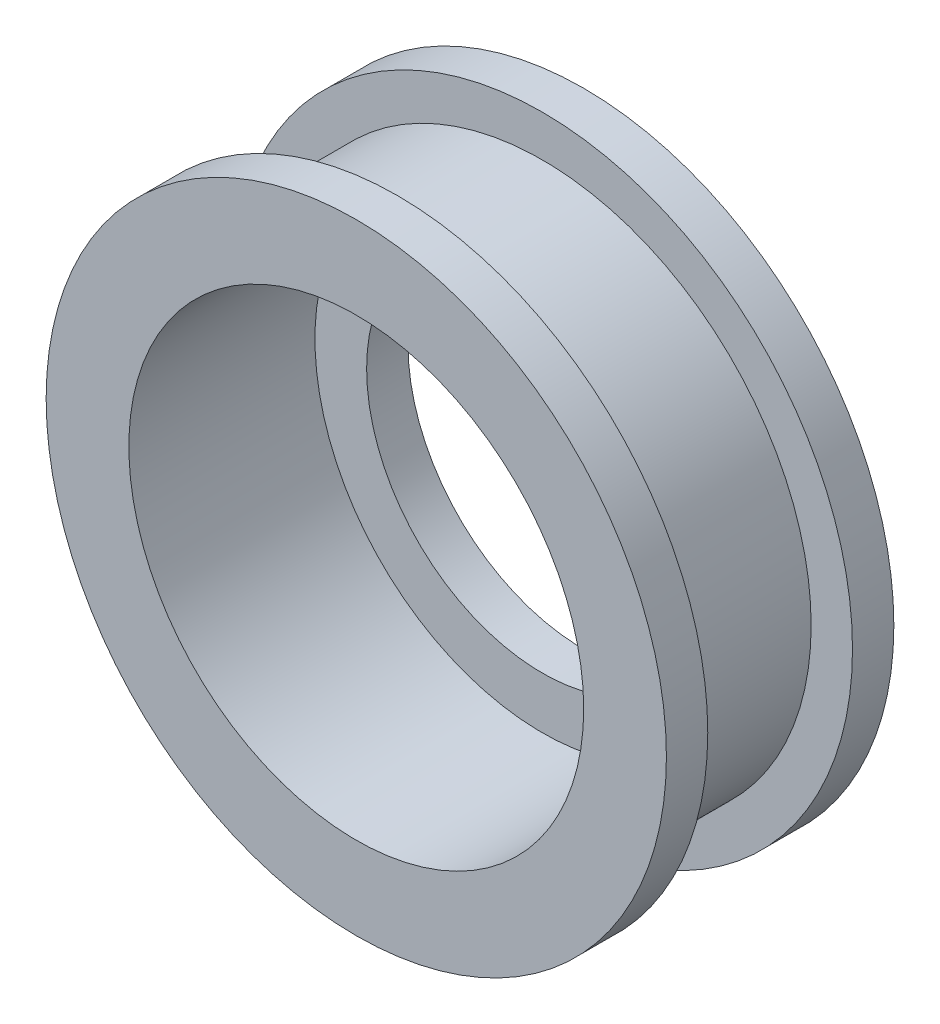
ISO-10303-21;
HEADER;
FILE_DESCRIPTION(('STEP AP214'),'2;1');
FILE_NAME('part.step','',(''),(''),'','','');
FILE_SCHEMA(('AUTOMOTIVE_DESIGN { 1 0 10303 214 1 1 1 1 }'));
ENDSEC;
DATA;
#1=APPLICATION_CONTEXT('core data for automotive mechanical design processes');
#2=APPLICATION_PROTOCOL_DEFINITION('international standard','automotive_design',2000,#1);
#3=PRODUCT_CONTEXT('',#1,'mechanical');
#4=PRODUCT('Part','Part','',(#3));
#5=PRODUCT_RELATED_PRODUCT_CATEGORY('part','',(#4));
#6=PRODUCT_DEFINITION_FORMATION('','',#4);
#7=PRODUCT_DEFINITION_CONTEXT('part definition',#1,'design');
#8=PRODUCT_DEFINITION('design','',#6,#7);
#9=PRODUCT_DEFINITION_SHAPE('','',#8);
#10=(LENGTH_UNIT() NAMED_UNIT(*) SI_UNIT(.MILLI.,.METRE.));
#11=(NAMED_UNIT(*) PLANE_ANGLE_UNIT() SI_UNIT($,.RADIAN.));
#12=(NAMED_UNIT(*) SI_UNIT($,.STERADIAN.) SOLID_ANGLE_UNIT());
#13=UNCERTAINTY_MEASURE_WITH_UNIT(LENGTH_MEASURE(1.E-05),#10,'distance_accuracy_value','');
#14=(GEOMETRIC_REPRESENTATION_CONTEXT(3) GLOBAL_UNCERTAINTY_ASSIGNED_CONTEXT((#13)) GLOBAL_UNIT_ASSIGNED_CONTEXT((#10,
#11,#12)) REPRESENTATION_CONTEXT('',''));
#15=CARTESIAN_POINT('',(0.,0.,0.));
#16=DIRECTION('',(0.,0.,1.));
#17=DIRECTION('',(1.,0.,0.));
#18=AXIS2_PLACEMENT_3D('',#15,#16,#17);
#19=CARTESIAN_POINT('',(0.,0.,2.));
#20=DIRECTION('',(0.,0.,1.));
#21=DIRECTION('',(1.,0.,0.));
#22=AXIS2_PLACEMENT_3D('',#19,#20,#21);
#23=PLANE('',#22);
#24=CARTESIAN_POINT('',(0.,0.,2.));
#25=DIRECTION('',(0.,0.,1.));
#26=DIRECTION('',(1.,0.,0.));
#27=AXIS2_PLACEMENT_3D('',#24,#25,#26);
#28=CIRCLE('',#27,8.5);
#29=CARTESIAN_POINT('',(8.5,0.,2.));
#30=VERTEX_POINT('',#29);
#31=EDGE_CURVE('E47',#30,#30,#28,.T.);
#32=ORIENTED_EDGE('',*,*,#31,.F.);
#33=EDGE_LOOP('',(#32));
#34=FACE_BOUND('',#33,.T.);
#35=CARTESIAN_POINT('',(0.,0.,2.));
#36=DIRECTION('',(0.,0.,1.));
#37=DIRECTION('',(1.,0.,0.));
#38=AXIS2_PLACEMENT_3D('',#35,#36,#37);
#39=CIRCLE('',#38,11.);
#40=CARTESIAN_POINT('',(11.,0.,2.));
#41=VERTEX_POINT('',#40);
#42=EDGE_CURVE('E55',#41,#41,#39,.T.);
#43=ORIENTED_EDGE('',*,*,#42,.T.);
#44=EDGE_LOOP('',(#43));
#45=FACE_BOUND('',#44,.T.);
#46=ADVANCED_FACE('F30',(#34,#45),#23,.T.);
#47=CARTESIAN_POINT('',(0.,0.,2.));
#48=DIRECTION('',(0.,0.,1.));
#49=DIRECTION('',(1.,0.,0.));
#50=AXIS2_PLACEMENT_3D('',#47,#48,#49);
#51=CIRCLE('',#50,13.);
#52=CARTESIAN_POINT('',(13.,0.,2.));
#53=VERTEX_POINT('',#52);
#54=EDGE_CURVE('E10',#53,#53,#51,.T.);
#55=ORIENTED_EDGE('',*,*,#54,.F.);
#56=EDGE_LOOP('',(#55));
#57=FACE_BOUND('',#56,.T.);
#58=CARTESIAN_POINT('',(0.,0.,2.));
#59=DIRECTION('',(0.,0.,1.));
#60=DIRECTION('',(1.,0.,0.));
#61=AXIS2_PLACEMENT_3D('',#58,#59,#60);
#62=CIRCLE('',#61,15.);
#63=CARTESIAN_POINT('',(15.,0.,2.));
#64=VERTEX_POINT('',#63);
#65=EDGE_CURVE('E38',#64,#64,#62,.T.);
#66=ORIENTED_EDGE('',*,*,#65,.T.);
#67=EDGE_LOOP('',(#66));
#68=FACE_BOUND('',#67,.T.);
#69=ADVANCED_FACE('F89',(#57,#68),#23,.T.);
#70=CARTESIAN_POINT('',(0.,0.,0.));
#71=DIRECTION('',(0.,0.,1.));
#72=DIRECTION('',(1.,0.,0.));
#73=AXIS2_PLACEMENT_3D('',#70,#71,#72);
#74=PLANE('',#73);
#75=CARTESIAN_POINT('',(0.,0.,0.));
#76=DIRECTION('',(0.,0.,1.));
#77=DIRECTION('',(1.,0.,0.));
#78=AXIS2_PLACEMENT_3D('',#75,#76,#77);
#79=CIRCLE('',#78,15.);
#80=CARTESIAN_POINT('',(15.,0.,0.));
#81=VERTEX_POINT('',#80);
#82=EDGE_CURVE('E34',#81,#81,#79,.T.);
#83=ORIENTED_EDGE('',*,*,#82,.F.);
#84=EDGE_LOOP('',(#83));
#85=FACE_BOUND('',#84,.T.);
#86=CARTESIAN_POINT('',(0.,0.,0.));
#87=DIRECTION('',(0.,0.,1.));
#88=DIRECTION('',(1.,0.,0.));
#89=AXIS2_PLACEMENT_3D('',#86,#87,#88);
#90=CIRCLE('',#89,8.5);
#91=CARTESIAN_POINT('',(8.5,0.,0.));
#92=VERTEX_POINT('',#91);
#93=EDGE_CURVE('E50',#92,#92,#90,.T.);
#94=ORIENTED_EDGE('',*,*,#93,.T.);
#95=EDGE_LOOP('',(#94));
#96=FACE_BOUND('',#95,.T.);
#97=ADVANCED_FACE('F95',(#85,#96),#74,.F.);
#98=CARTESIAN_POINT('',(0.,0.,2.));
#99=DIRECTION('',(0.,0.,-1.));
#100=DIRECTION('',(-1.,0.,0.));
#101=AXIS2_PLACEMENT_3D('',#98,#99,#100);
#102=CYLINDRICAL_SURFACE('',#101,15.);
#103=ORIENTED_EDGE('',*,*,#65,.F.);
#104=EDGE_LOOP('',(#103));
#105=FACE_BOUND('',#104,.T.);
#106=ORIENTED_EDGE('',*,*,#82,.T.);
#107=EDGE_LOOP('',(#106));
#108=FACE_BOUND('',#107,.T.);
#109=ADVANCED_FACE('F32',(#105,#108),#102,.T.);
#110=CARTESIAN_POINT('',(0.,0.,2.));
#111=DIRECTION('',(0.,0.,-1.));
#112=DIRECTION('',(-1.,0.,0.));
#113=AXIS2_PLACEMENT_3D('',#110,#111,#112);
#114=CYLINDRICAL_SURFACE('',#113,8.5);
#115=ORIENTED_EDGE('',*,*,#31,.T.);
#116=EDGE_LOOP('',(#115));
#117=FACE_BOUND('',#116,.T.);
#118=ORIENTED_EDGE('',*,*,#93,.F.);
#119=EDGE_LOOP('',(#118));
#120=FACE_BOUND('',#119,.T.);
#121=ADVANCED_FACE('F99',(#117,#120),#114,.F.);
#122=CARTESIAN_POINT('',(0.,0.,9.));
#123=DIRECTION('',(0.,0.,-1.));
#124=DIRECTION('',(-1.,0.,0.));
#125=AXIS2_PLACEMENT_3D('',#122,#123,#124);
#126=CYLINDRICAL_SURFACE('',#125,13.);
#127=CARTESIAN_POINT('',(0.,0.,9.));
#128=DIRECTION('',(0.,0.,1.));
#129=DIRECTION('',(1.,0.,0.));
#130=AXIS2_PLACEMENT_3D('',#127,#128,#129);
#131=CIRCLE('',#130,13.);
#132=CARTESIAN_POINT('',(13.,0.,9.));
#133=VERTEX_POINT('',#132);
#134=EDGE_CURVE('E45',#133,#133,#131,.T.);
#135=ORIENTED_EDGE('',*,*,#134,.F.);
#136=EDGE_LOOP('',(#135));
#137=FACE_BOUND('',#136,.T.);
#138=ORIENTED_EDGE('',*,*,#54,.T.);
#139=EDGE_LOOP('',(#138));
#140=FACE_BOUND('',#139,.T.);
#141=ADVANCED_FACE('F85',(#137,#140),#126,.T.);
#142=CARTESIAN_POINT('',(0.,0.,9.));
#143=DIRECTION('',(0.,0.,-1.));
#144=DIRECTION('',(-1.,0.,0.));
#145=AXIS2_PLACEMENT_3D('',#142,#143,#144);
#146=CYLINDRICAL_SURFACE('',#145,11.);
#147=ORIENTED_EDGE('',*,*,#42,.F.);
#148=EDGE_LOOP('',(#147));
#149=FACE_BOUND('',#148,.T.);
#150=CARTESIAN_POINT('',(0.,0.,11.));
#151=DIRECTION('',(0.,0.,1.));
#152=DIRECTION('',(1.,0.,0.));
#153=AXIS2_PLACEMENT_3D('',#150,#151,#152);
#154=CIRCLE('',#153,11.);
#155=CARTESIAN_POINT('',(11.,0.,11.));
#156=VERTEX_POINT('',#155);
#157=EDGE_CURVE('E67',#156,#156,#154,.T.);
#158=ORIENTED_EDGE('',*,*,#157,.T.);
#159=EDGE_LOOP('',(#158));
#160=FACE_BOUND('',#159,.T.);
#161=ADVANCED_FACE('F72',(#149,#160),#146,.F.);
#162=CARTESIAN_POINT('',(0.,0.,11.));
#163=DIRECTION('',(0.,0.,1.));
#164=DIRECTION('',(1.,0.,0.));
#165=AXIS2_PLACEMENT_3D('',#162,#163,#164);
#166=PLANE('',#165);
#167=CARTESIAN_POINT('',(0.,0.,11.));
#168=DIRECTION('',(0.,0.,1.));
#169=DIRECTION('',(1.,0.,0.));
#170=AXIS2_PLACEMENT_3D('',#167,#168,#169);
#171=CIRCLE('',#170,15.);
#172=CARTESIAN_POINT('',(15.,0.,11.));
#173=VERTEX_POINT('',#172);
#174=EDGE_CURVE('E59',#173,#173,#171,.T.);
#175=ORIENTED_EDGE('',*,*,#174,.T.);
#176=EDGE_LOOP('',(#175));
#177=FACE_BOUND('',#176,.T.);
#178=ORIENTED_EDGE('',*,*,#157,.F.);
#179=EDGE_LOOP('',(#178));
#180=FACE_BOUND('',#179,.T.);
#181=ADVANCED_FACE('F74',(#177,#180),#166,.T.);
#182=CARTESIAN_POINT('',(0.,0.,9.));
#183=DIRECTION('',(0.,0.,1.));
#184=DIRECTION('',(1.,0.,0.));
#185=AXIS2_PLACEMENT_3D('',#182,#183,#184);
#186=PLANE('',#185);
#187=ORIENTED_EDGE('',*,*,#134,.T.);
#188=EDGE_LOOP('',(#187));
#189=FACE_BOUND('',#188,.T.);
#190=CARTESIAN_POINT('',(0.,0.,9.));
#191=DIRECTION('',(0.,0.,1.));
#192=DIRECTION('',(1.,0.,0.));
#193=AXIS2_PLACEMENT_3D('',#190,#191,#192);
#194=CIRCLE('',#193,15.);
#195=CARTESIAN_POINT('',(15.,0.,9.));
#196=VERTEX_POINT('',#195);
#197=EDGE_CURVE('E63',#196,#196,#194,.T.);
#198=ORIENTED_EDGE('',*,*,#197,.F.);
#199=EDGE_LOOP('',(#198));
#200=FACE_BOUND('',#199,.T.);
#201=ADVANCED_FACE('F76',(#189,#200),#186,.F.);
#202=CARTESIAN_POINT('',(0.,0.,11.));
#203=DIRECTION('',(0.,0.,-1.));
#204=DIRECTION('',(-1.,0.,0.));
#205=AXIS2_PLACEMENT_3D('',#202,#203,#204);
#206=CYLINDRICAL_SURFACE('',#205,15.);
#207=ORIENTED_EDGE('',*,*,#174,.F.);
#208=EDGE_LOOP('',(#207));
#209=FACE_BOUND('',#208,.T.);
#210=ORIENTED_EDGE('',*,*,#197,.T.);
#211=EDGE_LOOP('',(#210));
#212=FACE_BOUND('',#211,.T.);
#213=ADVANCED_FACE('F83',(#209,#212),#206,.T.);
#214=CLOSED_SHELL('',(#46,#69,#97,#109,#121,#141,#161,#181,#201,#213));
#215=MANIFOLD_SOLID_BREP('B2',#214);
#216=ADVANCED_BREP_SHAPE_REPRESENTATION('',(#18,#215),#14);
#217=SHAPE_DEFINITION_REPRESENTATION(#9,#216);
ENDSEC;
END-ISO-10303-21;
